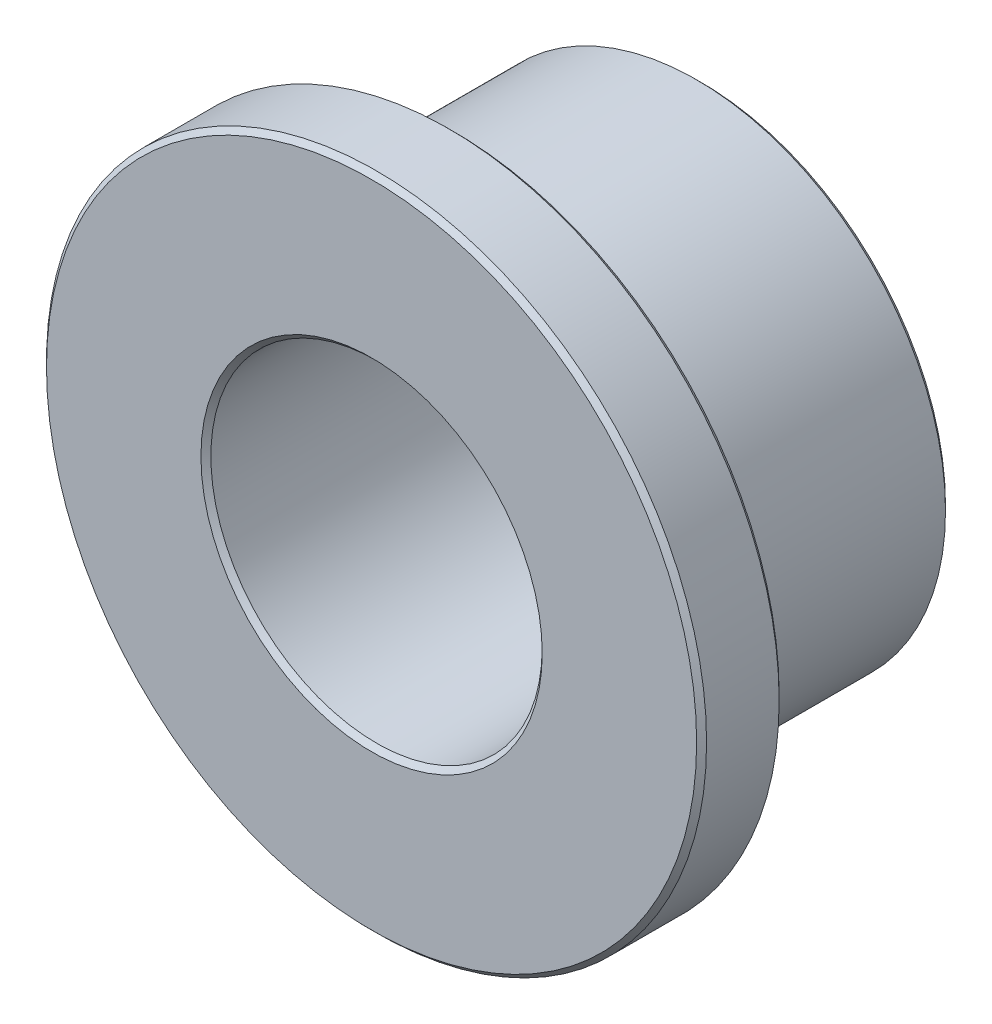
ISO-10303-21;
HEADER;
FILE_DESCRIPTION(('STEP AP214'),'2;1');
FILE_NAME('part.step','',(''),(''),'','','');
FILE_SCHEMA(('AUTOMOTIVE_DESIGN { 1 0 10303 214 1 1 1 1 }'));
ENDSEC;
DATA;
#1=APPLICATION_CONTEXT('core data for automotive mechanical design processes');
#2=APPLICATION_PROTOCOL_DEFINITION('international standard','automotive_design',2000,#1);
#3=PRODUCT_CONTEXT('',#1,'mechanical');
#4=PRODUCT('Part','Part','',(#3));
#5=PRODUCT_RELATED_PRODUCT_CATEGORY('part','',(#4));
#6=PRODUCT_DEFINITION_FORMATION('','',#4);
#7=PRODUCT_DEFINITION_CONTEXT('part definition',#1,'design');
#8=PRODUCT_DEFINITION('design','',#6,#7);
#9=PRODUCT_DEFINITION_SHAPE('','',#8);
#10=(LENGTH_UNIT() NAMED_UNIT(*) SI_UNIT(.MILLI.,.METRE.));
#11=(NAMED_UNIT(*) PLANE_ANGLE_UNIT() SI_UNIT($,.RADIAN.));
#12=(NAMED_UNIT(*) SI_UNIT($,.STERADIAN.) SOLID_ANGLE_UNIT());
#13=UNCERTAINTY_MEASURE_WITH_UNIT(LENGTH_MEASURE(1.E-05),#10,'distance_accuracy_value','');
#14=(GEOMETRIC_REPRESENTATION_CONTEXT(3) GLOBAL_UNCERTAINTY_ASSIGNED_CONTEXT((#13)) GLOBAL_UNIT_ASSIGNED_CONTEXT((#10,
#11,#12)) REPRESENTATION_CONTEXT('',''));
#15=CARTESIAN_POINT('',(0.,0.,0.));
#16=DIRECTION('',(0.,0.,1.));
#17=DIRECTION('',(1.,0.,0.));
#18=AXIS2_PLACEMENT_3D('',#15,#16,#17);
#19=CARTESIAN_POINT('',(0.,0.,1.5875));
#20=DIRECTION('',(0.,0.,1.));
#21=DIRECTION('',(1.,0.,0.));
#22=AXIS2_PLACEMENT_3D('',#19,#20,#21);
#23=CYLINDRICAL_SURFACE('',#22,6.35);
#24=CARTESIAN_POINT('',(0.,0.,3.079369));
#25=DIRECTION('',(0.,0.,1.));
#26=DIRECTION('',(1.,0.,0.));
#27=AXIS2_PLACEMENT_3D('',#24,#25,#26);
#28=CIRCLE('',#27,6.35);
#29=CARTESIAN_POINT('',(6.35,0.,3.079369));
#30=VERTEX_POINT('',#29);
#31=EDGE_CURVE('E60',#30,#30,#28,.F.);
#32=ORIENTED_EDGE('',*,*,#31,.T.);
#33=EDGE_LOOP('',(#32));
#34=FACE_BOUND('',#33,.T.);
#35=CARTESIAN_POINT('',(0.,0.,1.683131));
#36=DIRECTION('',(0.,0.,1.));
#37=DIRECTION('',(1.,0.,0.));
#38=AXIS2_PLACEMENT_3D('',#35,#36,#37);
#39=CIRCLE('',#38,6.35);
#40=CARTESIAN_POINT('',(6.35,0.,1.683131));
#41=VERTEX_POINT('',#40);
#42=EDGE_CURVE('E63',#41,#41,#39,.T.);
#43=ORIENTED_EDGE('',*,*,#42,.T.);
#44=EDGE_LOOP('',(#43));
#45=FACE_BOUND('',#44,.T.);
#46=ADVANCED_FACE('F34',(#34,#45),#23,.T.);
#47=CARTESIAN_POINT('',(0.,0.,1.5875));
#48=DIRECTION('',(0.,0.,1.));
#49=DIRECTION('',(1.,0.,0.));
#50=AXIS2_PLACEMENT_3D('',#47,#48,#49);
#51=PLANE('',#50);
#52=CARTESIAN_POINT('',(0.,0.,1.5875));
#53=DIRECTION('',(0.,0.,1.));
#54=DIRECTION('',(1.,0.,0.));
#55=AXIS2_PLACEMENT_3D('',#52,#53,#54);
#56=CIRCLE('',#55,6.254369);
#57=CARTESIAN_POINT('',(6.254369,0.,1.5875));
#58=VERTEX_POINT('',#57);
#59=EDGE_CURVE('E54',#58,#58,#56,.F.);
#60=ORIENTED_EDGE('',*,*,#59,.T.);
#61=EDGE_LOOP('',(#60));
#62=FACE_BOUND('',#61,.T.);
#63=CARTESIAN_POINT('',(0.,0.,1.5875));
#64=DIRECTION('',(0.,0.,1.));
#65=DIRECTION('',(1.,0.,0.));
#66=AXIS2_PLACEMENT_3D('',#63,#64,#65);
#67=CIRCLE('',#66,4.88353099999999);
#68=CARTESIAN_POINT('',(4.88353099999999,0.,1.5875));
#69=VERTEX_POINT('',#68);
#70=EDGE_CURVE('E57',#69,#69,#67,.T.);
#71=ORIENTED_EDGE('',*,*,#70,.T.);
#72=EDGE_LOOP('',(#71));
#73=FACE_BOUND('',#72,.T.);
#74=ADVANCED_FACE('F94',(#62,#73),#51,.F.);
#75=CARTESIAN_POINT('',(0.,0.,3.175));
#76=DIRECTION('',(0.,0.,1.));
#77=DIRECTION('',(1.,0.,0.));
#78=AXIS2_PLACEMENT_3D('',#75,#76,#77);
#79=PLANE('',#78);
#80=CARTESIAN_POINT('',(0.,0.,3.175));
#81=DIRECTION('',(0.,0.,1.));
#82=DIRECTION('',(1.,0.,0.));
#83=AXIS2_PLACEMENT_3D('',#80,#81,#82);
#84=CIRCLE('',#83,3.283331);
#85=CARTESIAN_POINT('',(3.283331,0.,3.175));
#86=VERTEX_POINT('',#85);
#87=EDGE_CURVE('E66',#86,#86,#84,.F.);
#88=ORIENTED_EDGE('',*,*,#87,.T.);
#89=EDGE_LOOP('',(#88));
#90=FACE_BOUND('',#89,.T.);
#91=CARTESIAN_POINT('',(0.,0.,3.175));
#92=DIRECTION('',(0.,0.,1.));
#93=DIRECTION('',(1.,0.,0.));
#94=AXIS2_PLACEMENT_3D('',#91,#92,#93);
#95=CIRCLE('',#94,6.254369);
#96=CARTESIAN_POINT('',(6.254369,0.,3.175));
#97=VERTEX_POINT('',#96);
#98=EDGE_CURVE('E69',#97,#97,#95,.T.);
#99=ORIENTED_EDGE('',*,*,#98,.T.);
#100=EDGE_LOOP('',(#99));
#101=FACE_BOUND('',#100,.T.);
#102=ADVANCED_FACE('F100',(#90,#101),#79,.T.);
#103=CARTESIAN_POINT('',(0.,0.,1.5875));
#104=DIRECTION('',(0.,0.,1.));
#105=DIRECTION('',(1.,0.,0.));
#106=AXIS2_PLACEMENT_3D('',#103,#104,#105);
#107=CYLINDRICAL_SURFACE('',#106,3.1877);
#108=CARTESIAN_POINT('',(0.,0.,3.079369));
#109=DIRECTION('',(0.,0.,1.));
#110=DIRECTION('',(1.,0.,0.));
#111=AXIS2_PLACEMENT_3D('',#108,#109,#110);
#112=CIRCLE('',#111,3.1877);
#113=CARTESIAN_POINT('',(3.1877,0.,3.079369));
#114=VERTEX_POINT('',#113);
#115=EDGE_CURVE('E72',#114,#114,#112,.T.);
#116=ORIENTED_EDGE('',*,*,#115,.T.);
#117=EDGE_LOOP('',(#116));
#118=FACE_BOUND('',#117,.T.);
#119=CARTESIAN_POINT('',(0.,0.,-3.079369));
#120=DIRECTION('',(0.,0.,1.));
#121=DIRECTION('',(1.,0.,0.));
#122=AXIS2_PLACEMENT_3D('',#119,#120,#121);
#123=CIRCLE('',#122,3.1877);
#124=CARTESIAN_POINT('',(3.1877,0.,-3.079369));
#125=VERTEX_POINT('',#124);
#126=EDGE_CURVE('E75',#125,#125,#123,.F.);
#127=ORIENTED_EDGE('',*,*,#126,.T.);
#128=EDGE_LOOP('',(#127));
#129=FACE_BOUND('',#128,.T.);
#130=ADVANCED_FACE('F79',(#118,#129),#107,.F.);
#131=CARTESIAN_POINT('',(0.,0.,-3.175));
#132=DIRECTION('',(0.,0.,1.));
#133=DIRECTION('',(1.,0.,0.));
#134=AXIS2_PLACEMENT_3D('',#131,#132,#133);
#135=CYLINDRICAL_SURFACE('',#134,4.7879);
#136=CARTESIAN_POINT('',(0.,0.,1.491869));
#137=DIRECTION('',(0.,0.,1.));
#138=DIRECTION('',(1.,0.,0.));
#139=AXIS2_PLACEMENT_3D('',#136,#137,#138);
#140=CIRCLE('',#139,4.7879);
#141=CARTESIAN_POINT('',(4.7879,0.,1.491869));
#142=VERTEX_POINT('',#141);
#143=EDGE_CURVE('E45',#142,#142,#140,.F.);
#144=CARTESIAN_POINT('',(0.,0.,-3.07936899999999));
#145=DIRECTION('',(0.,0.,1.));
#146=DIRECTION('',(1.,0.,0.));
#147=AXIS2_PLACEMENT_3D('',#144,#145,#146);
#148=CIRCLE('',#147,4.7879);
#149=CARTESIAN_POINT('',(4.7879,0.,-3.07936899999999));
#150=VERTEX_POINT('',#149);
#151=EDGE_CURVE('E49',#150,#150,#148,.T.);
#152=CARTESIAN_POINT('',(4.7879,0.,1.491869));
#153=CARTESIAN_POINT('',(4.7879,0.,1.4442519375));
#154=CARTESIAN_POINT('',(4.7879,0.,1.396634875));
#155=CARTESIAN_POINT('',(4.7879,0.,1.30140075));
#156=CARTESIAN_POINT('',(4.7879,0.,1.2537836875));
#157=CARTESIAN_POINT('',(4.7879,0.,1.1585495625));
#158=CARTESIAN_POINT('',(4.7879,0.,1.1109325));
#159=CARTESIAN_POINT('',(4.7879,0.,1.015698375));
#160=CARTESIAN_POINT('',(4.7879,0.,0.968081312500005));
#161=CARTESIAN_POINT('',(4.7879,0.,0.872847187500004));
#162=CARTESIAN_POINT('',(4.7879,0.,0.825230125000004));
#163=CARTESIAN_POINT('',(4.7879,0.,0.729996000000004));
#164=CARTESIAN_POINT('',(4.7879,0.,0.682378937500005));
#165=CARTESIAN_POINT('',(4.7879,0.,0.587144812500005));
#166=CARTESIAN_POINT('',(4.7879,0.,0.539527750000005));
#167=CARTESIAN_POINT('',(4.7879,0.,0.444293625000005));
#168=CARTESIAN_POINT('',(4.7879,0.,0.396676562500005));
#169=CARTESIAN_POINT('',(4.7879,0.,0.301442437500005));
#170=CARTESIAN_POINT('',(4.7879,0.,0.253825375000005));
#171=CARTESIAN_POINT('',(4.7879,0.,0.158591250000005));
#172=CARTESIAN_POINT('',(4.7879,0.,0.110974187500005));
#173=CARTESIAN_POINT('',(4.7879,0.,0.0157400625000052));
#174=CARTESIAN_POINT('',(4.7879,0.,-0.0318769999999947));
#175=CARTESIAN_POINT('',(4.7879,0.,-0.127111124999995));
#176=CARTESIAN_POINT('',(4.7879,0.,-0.174728187499995));
#177=CARTESIAN_POINT('',(4.7879,0.,-0.269962312499995));
#178=CARTESIAN_POINT('',(4.7879,0.,-0.317579374999995));
#179=CARTESIAN_POINT('',(4.7879,0.,-0.412813499999995));
#180=CARTESIAN_POINT('',(4.7879,0.,-0.460430562499995));
#181=CARTESIAN_POINT('',(4.7879,0.,-0.555664687499995));
#182=CARTESIAN_POINT('',(4.7879,0.,-0.603281749999995));
#183=CARTESIAN_POINT('',(4.7879,0.,-0.698515874999994));
#184=CARTESIAN_POINT('',(4.7879,0.,-0.746132937499994));
#185=CARTESIAN_POINT('',(4.7879,0.,-0.841367062499995));
#186=CARTESIAN_POINT('',(4.7879,0.,-0.888984124999995));
#187=CARTESIAN_POINT('',(4.7879,0.,-0.984218249999995));
#188=CARTESIAN_POINT('',(4.7879,0.,-1.03183531249999));
#189=CARTESIAN_POINT('',(4.7879,0.,-1.12706943749999));
#190=CARTESIAN_POINT('',(4.7879,0.,-1.17468649999999));
#191=CARTESIAN_POINT('',(4.7879,0.,-1.26992062499999));
#192=CARTESIAN_POINT('',(4.7879,0.,-1.31753768749999));
#193=CARTESIAN_POINT('',(4.7879,0.,-1.41277181249999));
#194=CARTESIAN_POINT('',(4.7879,0.,-1.46038887499999));
#195=CARTESIAN_POINT('',(4.7879,0.,-1.55562299999999));
#196=CARTESIAN_POINT('',(4.7879,0.,-1.60324006249999));
#197=CARTESIAN_POINT('',(4.7879,0.,-1.69847418749999));
#198=CARTESIAN_POINT('',(4.7879,0.,-1.74609124999999));
#199=CARTESIAN_POINT('',(4.7879,0.,-1.84132537499999));
#200=CARTESIAN_POINT('',(4.7879,0.,-1.88894243749999));
#201=CARTESIAN_POINT('',(4.7879,0.,-1.98417656249999));
#202=CARTESIAN_POINT('',(4.7879,0.,-2.03179362499999));
#203=CARTESIAN_POINT('',(4.7879,0.,-2.12702774999999));
#204=CARTESIAN_POINT('',(4.7879,0.,-2.17464481249999));
#205=CARTESIAN_POINT('',(4.7879,0.,-2.26987893749999));
#206=CARTESIAN_POINT('',(4.7879,0.,-2.31749599999999));
#207=CARTESIAN_POINT('',(4.7879,0.,-2.41273012499999));
#208=CARTESIAN_POINT('',(4.7879,0.,-2.46034718749999));
#209=CARTESIAN_POINT('',(4.7879,0.,-2.55558131249999));
#210=CARTESIAN_POINT('',(4.7879,0.,-2.60319837499999));
#211=CARTESIAN_POINT('',(4.7879,0.,-2.69843249999999));
#212=CARTESIAN_POINT('',(4.7879,0.,-2.74604956249999));
#213=CARTESIAN_POINT('',(4.7879,0.,-2.84128368749999));
#214=CARTESIAN_POINT('',(4.7879,0.,-2.88890074999999));
#215=CARTESIAN_POINT('',(4.7879,0.,-2.98413487499999));
#216=CARTESIAN_POINT('',(4.7879,0.,-3.03175193749999));
#217=CARTESIAN_POINT('',(4.7879,0.,-3.07936899999999));
#218=B_SPLINE_CURVE_WITH_KNOTS('',3,(#152,#153,#154,#155,#156,#157,#158,#159,#160,#161,#162,
#163,#164,#165,#166,#167,#168,#169,#170,#171,#172,#173,#174,#175,#176,#177,#178,#179,#180,#181,
#182,#183,#184,#185,#186,#187,#188,#189,#190,#191,#192,#193,#194,#195,#196,#197,#198,#199,#200,
#201,#202,#203,#204,#205,#206,#207,#208,#209,#210,#211,#212,#213,#214,#215,#216,#217),
.UNSPECIFIED.,.F.,.F.,(4,2,2,2,2,2,2,2,2,2,2,2,2,2,2,2,2,2,2,2,2,2,2,2,2,2,2,2,2,2,2,2,4),(0.,
0.1428511875,0.285702375,0.4285535625,0.57140475,0.7142559375,0.857107124999999,
0.999958312499999,1.1428095,1.2856606875,1.428511875,1.5713630625,1.71421425,1.8570654375,
1.999916625,2.1427678125,2.285619,2.4284701875,2.571321375,2.7141725625,2.85702375,2.9998749375,
3.142726125,3.2855773125,3.4284285,3.5712796875,3.714130875,3.8569820625,3.99983325,
4.1426844375,4.285535625,4.4283868125,4.571238),.UNSPECIFIED.);
#219=EDGE_CURVE('BSEAM162',#142,#150,#218,.T.);
#220=ORIENTED_EDGE('',*,*,#143,.T.);
#221=ORIENTED_EDGE('',*,*,#151,.T.);
#222=ORIENTED_EDGE('',*,*,#219,.T.);
#223=ORIENTED_EDGE('',*,*,#219,.F.);
#224=EDGE_LOOP('',(#220,#222,#221,#223));
#225=FACE_BOUND('',#224,.T.);
#226=ADVANCED_FACE('F162',(#225),#135,.T.);
#227=CARTESIAN_POINT('',(0.,0.,-3.175));
#228=DIRECTION('',(0.,0.,1.));
#229=DIRECTION('',(1.,0.,0.));
#230=AXIS2_PLACEMENT_3D('',#227,#228,#229);
#231=PLANE('',#230);
#232=CARTESIAN_POINT('',(0.,0.,-3.175));
#233=DIRECTION('',(0.,0.,1.));
#234=DIRECTION('',(1.,0.,0.));
#235=AXIS2_PLACEMENT_3D('',#232,#233,#234);
#236=CIRCLE('',#235,3.283331);
#237=CARTESIAN_POINT('',(3.283331,0.,-3.175));
#238=VERTEX_POINT('',#237);
#239=EDGE_CURVE('E10',#238,#238,#236,.T.);
#240=ORIENTED_EDGE('',*,*,#239,.T.);
#241=EDGE_LOOP('',(#240));
#242=FACE_BOUND('',#241,.T.);
#243=CARTESIAN_POINT('',(0.,0.,-3.175));
#244=DIRECTION('',(0.,0.,1.));
#245=DIRECTION('',(1.,0.,0.));
#246=AXIS2_PLACEMENT_3D('',#243,#244,#245);
#247=CIRCLE('',#246,4.69226899999999);
#248=CARTESIAN_POINT('',(4.69226899999999,0.,-3.175));
#249=VERTEX_POINT('',#248);
#250=EDGE_CURVE('E41',#249,#249,#247,.F.);
#251=ORIENTED_EDGE('',*,*,#250,.T.);
#252=EDGE_LOOP('',(#251));
#253=FACE_BOUND('',#252,.T.);
#254=ADVANCED_FACE('F110',(#242,#253),#231,.F.);
#255=CARTESIAN_POINT('',(0.,0.,3.079369));
#256=DIRECTION('',(0.,0.,1.));
#257=DIRECTION('',(1.,0.,0.));
#258=AXIS2_PLACEMENT_3D('',#255,#256,#257);
#259=CONICAL_SURFACE('',#258,3.1877,0.785398163397444);
#260=ORIENTED_EDGE('',*,*,#87,.F.);
#261=EDGE_LOOP('',(#260));
#262=FACE_BOUND('',#261,.T.);
#263=ORIENTED_EDGE('',*,*,#115,.F.);
#264=EDGE_LOOP('',(#263));
#265=FACE_BOUND('',#264,.T.);
#266=ADVANCED_FACE('F106',(#262,#265),#259,.F.);
#267=CARTESIAN_POINT('',(0.,0.,3.175));
#268=DIRECTION('',(0.,0.,-1.));
#269=DIRECTION('',(-1.,0.,0.));
#270=AXIS2_PLACEMENT_3D('',#267,#268,#269);
#271=CONICAL_SURFACE('',#270,6.254369,0.785398163397444);
#272=ORIENTED_EDGE('',*,*,#31,.F.);
#273=EDGE_LOOP('',(#272));
#274=FACE_BOUND('',#273,.T.);
#275=ORIENTED_EDGE('',*,*,#98,.F.);
#276=EDGE_LOOP('',(#275));
#277=FACE_BOUND('',#276,.T.);
#278=ADVANCED_FACE('F109',(#274,#277),#271,.T.);
#279=CARTESIAN_POINT('',(0.,0.,1.683131));
#280=DIRECTION('',(0.,0.,1.));
#281=DIRECTION('',(1.,0.,0.));
#282=AXIS2_PLACEMENT_3D('',#279,#280,#281);
#283=CONICAL_SURFACE('',#282,6.35,0.785398163397448);
#284=ORIENTED_EDGE('',*,*,#59,.F.);
#285=EDGE_LOOP('',(#284));
#286=FACE_BOUND('',#285,.T.);
#287=ORIENTED_EDGE('',*,*,#42,.F.);
#288=EDGE_LOOP('',(#287));
#289=FACE_BOUND('',#288,.T.);
#290=ADVANCED_FACE('F90',(#286,#289),#283,.T.);
#291=CARTESIAN_POINT('',(0.,0.,1.5875));
#292=DIRECTION('',(0.,0.,1.));
#293=DIRECTION('',(1.,0.,0.));
#294=AXIS2_PLACEMENT_3D('',#291,#292,#293);
#295=CONICAL_SURFACE('',#294,4.88353099999999,0.785398163397453);
#296=ORIENTED_EDGE('',*,*,#143,.F.);
#297=EDGE_LOOP('',(#296));
#298=FACE_BOUND('',#297,.T.);
#299=ORIENTED_EDGE('',*,*,#70,.F.);
#300=EDGE_LOOP('',(#299));
#301=FACE_BOUND('',#300,.T.);
#302=ADVANCED_FACE('F84',(#298,#301),#295,.T.);
#303=CARTESIAN_POINT('',(0.,0.,-3.175));
#304=DIRECTION('',(0.,0.,-1.));
#305=DIRECTION('',(-1.,0.,0.));
#306=AXIS2_PLACEMENT_3D('',#303,#304,#305);
#307=CONICAL_SURFACE('',#306,3.283331,0.785398163397444);
#308=ORIENTED_EDGE('',*,*,#126,.F.);
#309=EDGE_LOOP('',(#308));
#310=FACE_BOUND('',#309,.T.);
#311=ORIENTED_EDGE('',*,*,#239,.F.);
#312=EDGE_LOOP('',(#311));
#313=FACE_BOUND('',#312,.T.);
#314=ADVANCED_FACE('F81',(#310,#313),#307,.F.);
#315=CARTESIAN_POINT('',(0.,0.,-3.07936899999999));
#316=DIRECTION('',(0.,0.,1.));
#317=DIRECTION('',(1.,0.,0.));
#318=AXIS2_PLACEMENT_3D('',#315,#316,#317);
#319=CONICAL_SURFACE('',#318,4.7879,0.785398163397444);
#320=ORIENTED_EDGE('',*,*,#250,.F.);
#321=EDGE_LOOP('',(#320));
#322=FACE_BOUND('',#321,.T.);
#323=ORIENTED_EDGE('',*,*,#151,.F.);
#324=EDGE_LOOP('',(#323));
#325=FACE_BOUND('',#324,.T.);
#326=ADVANCED_FACE('F36',(#322,#325),#319,.T.);
#327=CLOSED_SHELL('',(#46,#74,#102,#130,#226,#254,#266,#278,#290,#302,#314,#326));
#328=MANIFOLD_SOLID_BREP('B2',#327);
#329=ADVANCED_BREP_SHAPE_REPRESENTATION('',(#18,#328),#14);
#330=SHAPE_DEFINITION_REPRESENTATION(#9,#329);
ENDSEC;
END-ISO-10303-21;
